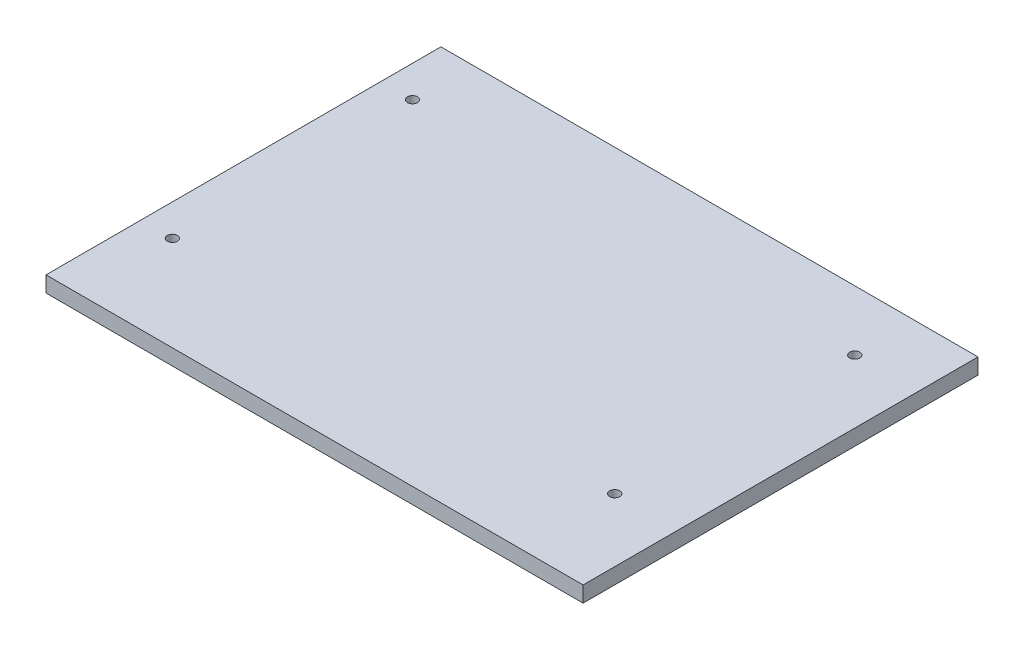
ISO-10303-21;
HEADER;
FILE_DESCRIPTION(('STEP AP214'),'2;1');
FILE_NAME('part.step','',(''),(''),'','','');
FILE_SCHEMA(('AUTOMOTIVE_DESIGN { 1 0 10303 214 1 1 1 1 }'));
ENDSEC;
DATA;
#1=APPLICATION_CONTEXT('core data for automotive mechanical design processes');
#2=APPLICATION_PROTOCOL_DEFINITION('international standard','automotive_design',2000,#1);
#3=PRODUCT_CONTEXT('',#1,'mechanical');
#4=PRODUCT('Part','Part','',(#3));
#5=PRODUCT_RELATED_PRODUCT_CATEGORY('part','',(#4));
#6=PRODUCT_DEFINITION_FORMATION('','',#4);
#7=PRODUCT_DEFINITION_CONTEXT('part definition',#1,'design');
#8=PRODUCT_DEFINITION('design','',#6,#7);
#9=PRODUCT_DEFINITION_SHAPE('','',#8);
#10=(LENGTH_UNIT() NAMED_UNIT(*) SI_UNIT(.MILLI.,.METRE.));
#11=(NAMED_UNIT(*) PLANE_ANGLE_UNIT() SI_UNIT($,.RADIAN.));
#12=(NAMED_UNIT(*) SI_UNIT($,.STERADIAN.) SOLID_ANGLE_UNIT());
#13=UNCERTAINTY_MEASURE_WITH_UNIT(LENGTH_MEASURE(1.E-05),#10,'distance_accuracy_value','');
#14=(GEOMETRIC_REPRESENTATION_CONTEXT(3) GLOBAL_UNCERTAINTY_ASSIGNED_CONTEXT((#13)) GLOBAL_UNIT_ASSIGNED_CONTEXT((#10,
#11,#12)) REPRESENTATION_CONTEXT('',''));
#15=CARTESIAN_POINT('',(0.,0.,0.));
#16=DIRECTION('',(0.,0.,1.));
#17=DIRECTION('',(1.,0.,0.));
#18=AXIS2_PLACEMENT_3D('',#15,#16,#17);
#19=CARTESIAN_POINT('',(0.,5.,0.));
#20=DIRECTION('',(0.,1.,0.));
#21=DIRECTION('',(0.,0.,1.));
#22=AXIS2_PLACEMENT_3D('',#19,#20,#21);
#23=PLANE('',#22);
#24=CARTESIAN_POINT('',(65.,5.,32.5));
#25=DIRECTION('',(0.,1.,0.));
#26=DIRECTION('',(0.,0.,1.));
#27=AXIS2_PLACEMENT_3D('',#24,#25,#26);
#28=CIRCLE('',#27,1.60000000000001);
#29=CARTESIAN_POINT('',(65.,5.,34.1));
#30=VERTEX_POINT('',#29);
#31=EDGE_CURVE('E123',#30,#30,#28,.T.);
#32=ORIENTED_EDGE('',*,*,#31,.F.);
#33=EDGE_LOOP('',(#32));
#34=FACE_BOUND('',#33,.T.);
#35=CARTESIAN_POINT('',(-75.,5.,-43.5));
#36=DIRECTION('',(0.,1.,0.));
#37=DIRECTION('',(0.,0.,1.));
#38=AXIS2_PLACEMENT_3D('',#35,#36,#37);
#39=CIRCLE('',#38,1.60000000000001);
#40=CARTESIAN_POINT('',(-75.,5.,-41.9));
#41=VERTEX_POINT('',#40);
#42=EDGE_CURVE('E102',#41,#41,#39,.T.);
#43=ORIENTED_EDGE('',*,*,#42,.F.);
#44=EDGE_LOOP('',(#43));
#45=FACE_BOUND('',#44,.T.);
#46=DIRECTION('',(0.,0.,1.));
#47=VECTOR('',#46,1.);
#48=CARTESIAN_POINT('',(-85.,5.,62.5));
#49=LINE('',#48,#47);
#50=CARTESIAN_POINT('',(-85.,5.,-62.5));
#51=VERTEX_POINT('',#50);
#52=CARTESIAN_POINT('',(-85.,5.,62.5));
#53=VERTEX_POINT('',#52);
#54=EDGE_CURVE('E87',#51,#53,#49,.T.);
#55=ORIENTED_EDGE('',*,*,#54,.T.);
#56=DIRECTION('',(1.,0.,0.));
#57=VECTOR('',#56,1.);
#58=CARTESIAN_POINT('',(85.,5.,62.5));
#59=LINE('',#58,#57);
#60=CARTESIAN_POINT('',(85.,5.,62.5));
#61=VERTEX_POINT('',#60);
#62=EDGE_CURVE('E82',#53,#61,#59,.T.);
#63=ORIENTED_EDGE('',*,*,#62,.T.);
#64=DIRECTION('',(0.,0.,-1.));
#65=VECTOR('',#64,1.);
#66=CARTESIAN_POINT('',(85.,5.,62.5));
#67=LINE('',#66,#65);
#68=CARTESIAN_POINT('',(85.,5.,-62.5));
#69=VERTEX_POINT('',#68);
#70=EDGE_CURVE('E85',#61,#69,#67,.T.);
#71=ORIENTED_EDGE('',*,*,#70,.T.);
#72=DIRECTION('',(-1.,0.,0.));
#73=VECTOR('',#72,1.);
#74=CARTESIAN_POINT('',(85.,5.,-62.5));
#75=LINE('',#74,#73);
#76=EDGE_CURVE('E52',#69,#51,#75,.T.);
#77=ORIENTED_EDGE('',*,*,#76,.T.);
#78=EDGE_LOOP('',(#55,#63,#71,#77));
#79=FACE_BOUND('',#78,.T.);
#80=CARTESIAN_POINT('',(-75.,5.,32.5));
#81=DIRECTION('',(0.,1.,0.));
#82=DIRECTION('',(0.,0.,1.));
#83=AXIS2_PLACEMENT_3D('',#80,#81,#82);
#84=CIRCLE('',#83,1.60000000000001);
#85=CARTESIAN_POINT('',(-75.,5.,34.1));
#86=VERTEX_POINT('',#85);
#87=EDGE_CURVE('E117',#86,#86,#84,.T.);
#88=ORIENTED_EDGE('',*,*,#87,.F.);
#89=EDGE_LOOP('',(#88));
#90=FACE_BOUND('',#89,.T.);
#91=CARTESIAN_POINT('',(65.,5.,-43.5));
#92=DIRECTION('',(0.,1.,0.));
#93=DIRECTION('',(0.,0.,1.));
#94=AXIS2_PLACEMENT_3D('',#91,#92,#93);
#95=CIRCLE('',#94,1.60000000000001);
#96=CARTESIAN_POINT('',(65.,5.,-41.9));
#97=VERTEX_POINT('',#96);
#98=EDGE_CURVE('E129',#97,#97,#95,.T.);
#99=ORIENTED_EDGE('',*,*,#98,.F.);
#100=EDGE_LOOP('',(#99));
#101=FACE_BOUND('',#100,.T.);
#102=ADVANCED_FACE('F35',(#34,#45,#79,#90,#101),#23,.T.);
#103=CARTESIAN_POINT('',(0.,0.,0.));
#104=DIRECTION('',(0.,1.,0.));
#105=DIRECTION('',(0.,0.,1.));
#106=AXIS2_PLACEMENT_3D('',#103,#104,#105);
#107=PLANE('',#106);
#108=DIRECTION('',(0.,0.,1.));
#109=VECTOR('',#108,1.);
#110=CARTESIAN_POINT('',(-85.,0.,62.5));
#111=LINE('',#110,#109);
#112=CARTESIAN_POINT('',(-85.,0.,-62.5));
#113=VERTEX_POINT('',#112);
#114=CARTESIAN_POINT('',(-85.,0.,62.5));
#115=VERTEX_POINT('',#114);
#116=EDGE_CURVE('E99',#113,#115,#111,.T.);
#117=ORIENTED_EDGE('',*,*,#116,.F.);
#118=DIRECTION('',(-1.,0.,0.));
#119=VECTOR('',#118,1.);
#120=CARTESIAN_POINT('',(85.,0.,-62.5));
#121=LINE('',#120,#119);
#122=CARTESIAN_POINT('',(85.,0.,-62.5));
#123=VERTEX_POINT('',#122);
#124=EDGE_CURVE('E75',#123,#113,#121,.T.);
#125=ORIENTED_EDGE('',*,*,#124,.F.);
#126=DIRECTION('',(0.,0.,-1.));
#127=VECTOR('',#126,1.);
#128=CARTESIAN_POINT('',(85.,0.,62.5));
#129=LINE('',#128,#127);
#130=CARTESIAN_POINT('',(85.,0.,62.5));
#131=VERTEX_POINT('',#130);
#132=EDGE_CURVE('E69',#131,#123,#129,.T.);
#133=ORIENTED_EDGE('',*,*,#132,.F.);
#134=DIRECTION('',(1.,0.,0.));
#135=VECTOR('',#134,1.);
#136=CARTESIAN_POINT('',(85.,0.,62.5));
#137=LINE('',#136,#135);
#138=EDGE_CURVE('E91',#115,#131,#137,.T.);
#139=ORIENTED_EDGE('',*,*,#138,.F.);
#140=EDGE_LOOP('',(#117,#125,#133,#139));
#141=FACE_BOUND('',#140,.T.);
#142=CARTESIAN_POINT('',(-75.,0.,-43.5));
#143=DIRECTION('',(0.,1.,0.));
#144=DIRECTION('',(0.,0.,1.));
#145=AXIS2_PLACEMENT_3D('',#142,#143,#144);
#146=CIRCLE('',#145,1.60000000000001);
#147=CARTESIAN_POINT('',(-75.,0.,-41.9));
#148=VERTEX_POINT('',#147);
#149=EDGE_CURVE('E114',#148,#148,#146,.T.);
#150=ORIENTED_EDGE('',*,*,#149,.T.);
#151=EDGE_LOOP('',(#150));
#152=FACE_BOUND('',#151,.T.);
#153=CARTESIAN_POINT('',(-75.,0.,32.5));
#154=DIRECTION('',(0.,1.,0.));
#155=DIRECTION('',(0.,0.,1.));
#156=AXIS2_PLACEMENT_3D('',#153,#154,#155);
#157=CIRCLE('',#156,1.60000000000001);
#158=CARTESIAN_POINT('',(-75.,0.,34.1));
#159=VERTEX_POINT('',#158);
#160=EDGE_CURVE('E120',#159,#159,#157,.T.);
#161=ORIENTED_EDGE('',*,*,#160,.T.);
#162=EDGE_LOOP('',(#161));
#163=FACE_BOUND('',#162,.T.);
#164=CARTESIAN_POINT('',(65.,0.,32.5));
#165=DIRECTION('',(0.,1.,0.));
#166=DIRECTION('',(0.,0.,1.));
#167=AXIS2_PLACEMENT_3D('',#164,#165,#166);
#168=CIRCLE('',#167,1.60000000000001);
#169=CARTESIAN_POINT('',(65.,0.,34.1));
#170=VERTEX_POINT('',#169);
#171=EDGE_CURVE('E126',#170,#170,#168,.T.);
#172=ORIENTED_EDGE('',*,*,#171,.T.);
#173=EDGE_LOOP('',(#172));
#174=FACE_BOUND('',#173,.T.);
#175=CARTESIAN_POINT('',(65.,0.,-43.5));
#176=DIRECTION('',(0.,1.,0.));
#177=DIRECTION('',(0.,0.,1.));
#178=AXIS2_PLACEMENT_3D('',#175,#176,#177);
#179=CIRCLE('',#178,1.60000000000001);
#180=CARTESIAN_POINT('',(65.,0.,-41.9));
#181=VERTEX_POINT('',#180);
#182=EDGE_CURVE('E132',#181,#181,#179,.T.);
#183=ORIENTED_EDGE('',*,*,#182,.T.);
#184=EDGE_LOOP('',(#183));
#185=FACE_BOUND('',#184,.T.);
#186=ADVANCED_FACE('F110',(#141,#152,#163,#174,#185),#107,.F.);
#187=CARTESIAN_POINT('',(-85.,5.,62.5));
#188=DIRECTION('',(1.,0.,0.));
#189=DIRECTION('',(0.,0.,-1.));
#190=AXIS2_PLACEMENT_3D('',#187,#188,#189);
#191=PLANE('',#190);
#192=ORIENTED_EDGE('',*,*,#116,.T.);
#193=DIRECTION('',(0.,-1.,0.));
#194=VECTOR('',#193,1.);
#195=CARTESIAN_POINT('',(-85.,5.,62.5));
#196=LINE('',#195,#194);
#197=EDGE_CURVE('E11',#53,#115,#196,.T.);
#198=ORIENTED_EDGE('',*,*,#197,.F.);
#199=ORIENTED_EDGE('',*,*,#54,.F.);
#200=DIRECTION('',(0.,-1.,0.));
#201=VECTOR('',#200,1.);
#202=CARTESIAN_POINT('',(-85.,5.,-62.5));
#203=LINE('',#202,#201);
#204=EDGE_CURVE('E95',#51,#113,#203,.T.);
#205=ORIENTED_EDGE('',*,*,#204,.T.);
#206=EDGE_LOOP('',(#192,#198,#199,#205));
#207=FACE_BOUND('',#206,.T.);
#208=ADVANCED_FACE('F37',(#207),#191,.F.);
#209=CARTESIAN_POINT('',(85.,5.,62.5));
#210=DIRECTION('',(0.,0.,-1.));
#211=DIRECTION('',(-1.,0.,0.));
#212=AXIS2_PLACEMENT_3D('',#209,#210,#211);
#213=PLANE('',#212);
#214=ORIENTED_EDGE('',*,*,#138,.T.);
#215=DIRECTION('',(0.,-1.,0.));
#216=VECTOR('',#215,1.);
#217=CARTESIAN_POINT('',(85.,5.,62.5));
#218=LINE('',#217,#216);
#219=EDGE_CURVE('E44',#61,#131,#218,.T.);
#220=ORIENTED_EDGE('',*,*,#219,.F.);
#221=ORIENTED_EDGE('',*,*,#62,.F.);
#222=ORIENTED_EDGE('',*,*,#197,.T.);
#223=EDGE_LOOP('',(#214,#220,#221,#222));
#224=FACE_BOUND('',#223,.T.);
#225=ADVANCED_FACE('F90',(#224),#213,.F.);
#226=CARTESIAN_POINT('',(85.,5.,62.5));
#227=DIRECTION('',(-1.,0.,0.));
#228=DIRECTION('',(0.,0.,1.));
#229=AXIS2_PLACEMENT_3D('',#226,#227,#228);
#230=PLANE('',#229);
#231=ORIENTED_EDGE('',*,*,#132,.T.);
#232=DIRECTION('',(0.,-1.,0.));
#233=VECTOR('',#232,1.);
#234=CARTESIAN_POINT('',(85.,5.,-62.5));
#235=LINE('',#234,#233);
#236=EDGE_CURVE('E92',#69,#123,#235,.T.);
#237=ORIENTED_EDGE('',*,*,#236,.F.);
#238=ORIENTED_EDGE('',*,*,#70,.F.);
#239=ORIENTED_EDGE('',*,*,#219,.T.);
#240=EDGE_LOOP('',(#231,#237,#238,#239));
#241=FACE_BOUND('',#240,.T.);
#242=ADVANCED_FACE('F93',(#241),#230,.F.);
#243=CARTESIAN_POINT('',(85.,5.,-62.5));
#244=DIRECTION('',(0.,0.,1.));
#245=DIRECTION('',(1.,0.,0.));
#246=AXIS2_PLACEMENT_3D('',#243,#244,#245);
#247=PLANE('',#246);
#248=ORIENTED_EDGE('',*,*,#124,.T.);
#249=ORIENTED_EDGE('',*,*,#204,.F.);
#250=ORIENTED_EDGE('',*,*,#76,.F.);
#251=ORIENTED_EDGE('',*,*,#236,.T.);
#252=EDGE_LOOP('',(#248,#249,#250,#251));
#253=FACE_BOUND('',#252,.T.);
#254=ADVANCED_FACE('F107',(#253),#247,.F.);
#255=CARTESIAN_POINT('',(-75.,5.,-43.5));
#256=DIRECTION('',(0.,-1.,0.));
#257=DIRECTION('',(0.,0.,-1.));
#258=AXIS2_PLACEMENT_3D('',#255,#256,#257);
#259=CYLINDRICAL_SURFACE('',#258,1.60000000000001);
#260=ORIENTED_EDGE('',*,*,#42,.T.);
#261=EDGE_LOOP('',(#260));
#262=FACE_BOUND('',#261,.T.);
#263=ORIENTED_EDGE('',*,*,#149,.F.);
#264=EDGE_LOOP('',(#263));
#265=FACE_BOUND('',#264,.T.);
#266=ADVANCED_FACE('F151',(#262,#265),#259,.F.);
#267=CARTESIAN_POINT('',(-75.,5.,32.5));
#268=DIRECTION('',(0.,-1.,0.));
#269=DIRECTION('',(0.,0.,-1.));
#270=AXIS2_PLACEMENT_3D('',#267,#268,#269);
#271=CYLINDRICAL_SURFACE('',#270,1.60000000000001);
#272=ORIENTED_EDGE('',*,*,#87,.T.);
#273=EDGE_LOOP('',(#272));
#274=FACE_BOUND('',#273,.T.);
#275=ORIENTED_EDGE('',*,*,#160,.F.);
#276=EDGE_LOOP('',(#275));
#277=FACE_BOUND('',#276,.T.);
#278=ADVANCED_FACE('F197',(#274,#277),#271,.F.);
#279=CARTESIAN_POINT('',(65.,5.,32.5));
#280=DIRECTION('',(0.,-1.,0.));
#281=DIRECTION('',(0.,0.,-1.));
#282=AXIS2_PLACEMENT_3D('',#279,#280,#281);
#283=CYLINDRICAL_SURFACE('',#282,1.60000000000001);
#284=ORIENTED_EDGE('',*,*,#31,.T.);
#285=EDGE_LOOP('',(#284));
#286=FACE_BOUND('',#285,.T.);
#287=ORIENTED_EDGE('',*,*,#171,.F.);
#288=EDGE_LOOP('',(#287));
#289=FACE_BOUND('',#288,.T.);
#290=ADVANCED_FACE('F205',(#286,#289),#283,.F.);
#291=CARTESIAN_POINT('',(65.,5.,-43.5));
#292=DIRECTION('',(0.,-1.,0.));
#293=DIRECTION('',(0.,0.,-1.));
#294=AXIS2_PLACEMENT_3D('',#291,#292,#293);
#295=CYLINDRICAL_SURFACE('',#294,1.60000000000001);
#296=ORIENTED_EDGE('',*,*,#98,.T.);
#297=EDGE_LOOP('',(#296));
#298=FACE_BOUND('',#297,.T.);
#299=ORIENTED_EDGE('',*,*,#182,.F.);
#300=EDGE_LOOP('',(#299));
#301=FACE_BOUND('',#300,.T.);
#302=ADVANCED_FACE('F138',(#298,#301),#295,.F.);
#303=CLOSED_SHELL('',(#102,#186,#208,#225,#242,#254,#266,#278,#290,#302));
#304=MANIFOLD_SOLID_BREP('B2',#303);
#305=ADVANCED_BREP_SHAPE_REPRESENTATION('',(#18,#304),#14);
#306=SHAPE_DEFINITION_REPRESENTATION(#9,#305);
ENDSEC;
END-ISO-10303-21;
